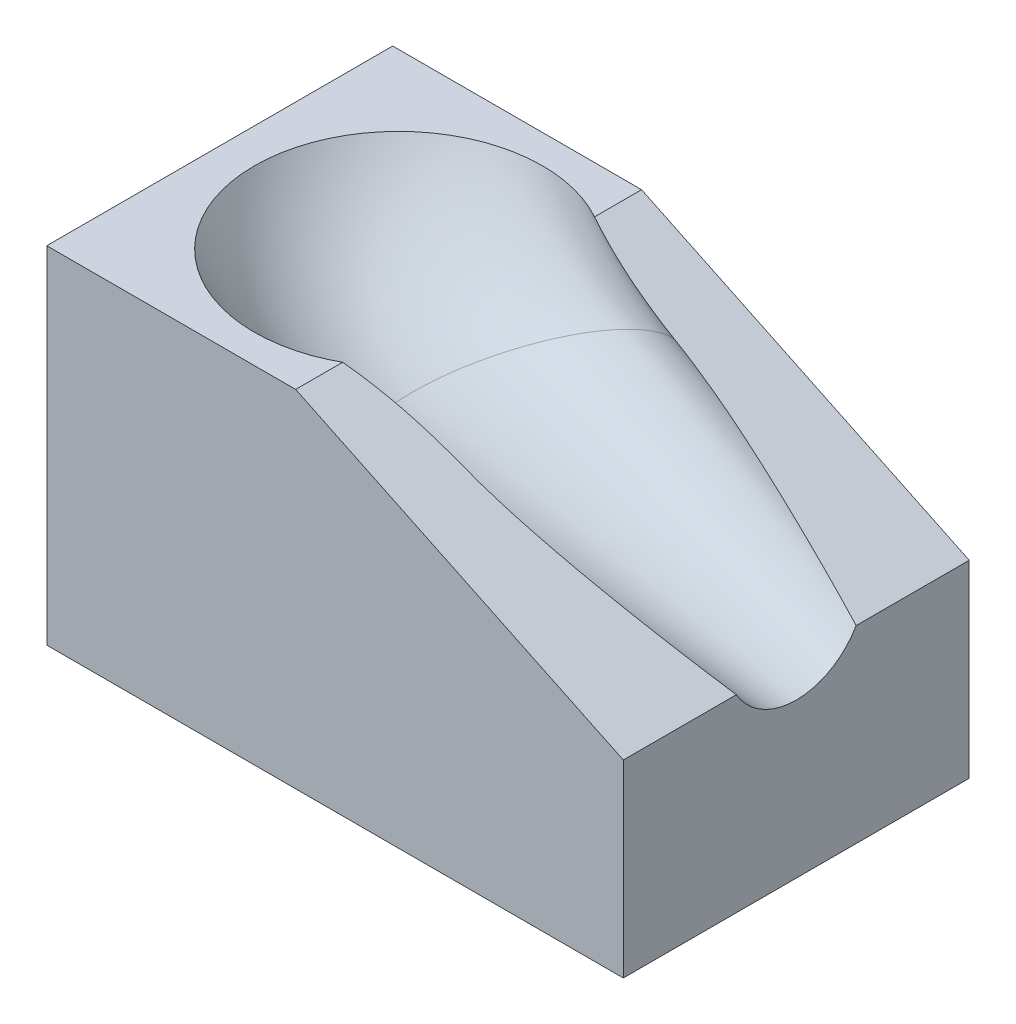
ISO-10303-21;
HEADER;
FILE_DESCRIPTION(('STEP AP214'),'2;1');
FILE_NAME('part.step','',(''),(''),'','','');
FILE_SCHEMA(('AUTOMOTIVE_DESIGN { 1 0 10303 214 1 1 1 1 }'));
ENDSEC;
DATA;
#1=APPLICATION_CONTEXT('core data for automotive mechanical design processes');
#2=APPLICATION_PROTOCOL_DEFINITION('international standard','automotive_design',2000,#1);
#3=PRODUCT_CONTEXT('',#1,'mechanical');
#4=PRODUCT('Part','Part','',(#3));
#5=PRODUCT_RELATED_PRODUCT_CATEGORY('part','',(#4));
#6=PRODUCT_DEFINITION_FORMATION('','',#4);
#7=PRODUCT_DEFINITION_CONTEXT('part definition',#1,'design');
#8=PRODUCT_DEFINITION('design','',#6,#7);
#9=PRODUCT_DEFINITION_SHAPE('','',#8);
#10=(LENGTH_UNIT() NAMED_UNIT(*) SI_UNIT(.MILLI.,.METRE.));
#11=(NAMED_UNIT(*) PLANE_ANGLE_UNIT() SI_UNIT($,.RADIAN.));
#12=(NAMED_UNIT(*) SI_UNIT($,.STERADIAN.) SOLID_ANGLE_UNIT());
#13=UNCERTAINTY_MEASURE_WITH_UNIT(LENGTH_MEASURE(1.E-05),#10,'distance_accuracy_value','');
#14=(GEOMETRIC_REPRESENTATION_CONTEXT(3) GLOBAL_UNCERTAINTY_ASSIGNED_CONTEXT((#13)) GLOBAL_UNIT_ASSIGNED_CONTEXT((#10,
#11,#12)) REPRESENTATION_CONTEXT('',''));
#15=CARTESIAN_POINT('',(0.,0.,0.));
#16=DIRECTION('',(0.,0.,1.));
#17=DIRECTION('',(1.,0.,0.));
#18=AXIS2_PLACEMENT_3D('',#15,#16,#17);
#19=CARTESIAN_POINT('',(21.5839694656488,30.,15.));
#20=DIRECTION('',(-0.432376669649816,-0.901693082785121,0.));
#21=DIRECTION('',(0.901693082785121,-0.432376669649816,0.));
#22=AXIS2_PLACEMENT_3D('',#19,#20,#21);
#23=PLANE('',#22);
#24=CARTESIAN_POINT('',(21.5839694656486,30.,-10.919340613132));
#25=CARTESIAN_POINT('',(21.710412416116,29.9393685247592,-10.8772290723294));
#26=CARTESIAN_POINT('',(21.8370421361183,29.8786474904532,-10.8358080970463));
#27=CARTESIAN_POINT('',(22.0906916703588,29.7570183652365,-10.7544542890336));
#28=CARTESIAN_POINT('',(22.217711490828,29.6961102713379,-10.7145214802094));
#29=CARTESIAN_POINT('',(22.5993806580954,29.5130936256502,-10.5971160330896));
#30=CARTESIAN_POINT('',(22.8546339264675,29.3906954835295,-10.5220383108888));
#31=CARTESIAN_POINT('',(23.3665145319301,29.1452403107288,-10.3788291570108));
#32=CARTESIAN_POINT('',(23.6231406852334,29.0221838476942,-10.3106925203233));
#33=CARTESIAN_POINT('',(24.1378218204988,28.7753857747731,-10.1814504777418));
#34=CARTESIAN_POINT('',(24.3958767627952,28.651644183907,-10.1203448776693));
#35=CARTESIAN_POINT('',(24.8788528294104,28.4200492130787,-10.0127192041851));
#36=CARTESIAN_POINT('',(25.1036187495999,28.3122702560503,-9.96534002460255));
#37=CARTESIAN_POINT('',(25.5539622178243,28.0963231530871,-9.87560948090011));
#38=CARTESIAN_POINT('',(25.7795397698737,27.9881550052273,-9.83325814168493));
#39=CARTESIAN_POINT('',(26.4574183008858,27.6631010957964,-9.71338287216062));
#40=CARTESIAN_POINT('',(26.910770246602,27.4457113783744,-9.64305863402589));
#41=CARTESIAN_POINT('',(27.5932760283685,27.11843862607,-9.55015877570098));
#42=CARTESIAN_POINT('',(27.821756107271,27.0088786688259,-9.521234384241));
#43=CARTESIAN_POINT('',(28.2791034892705,26.7895730739652,-9.46735180896929));
#44=CARTESIAN_POINT('',(28.5079707988605,26.679827433235,-9.44239369234334));
#45=CARTESIAN_POINT('',(28.9658894098282,26.460247924685,-9.39612059219671));
#46=CARTESIAN_POINT('',(29.1949405685952,26.3504141252494,-9.37480385173653));
#47=CARTESIAN_POINT('',(29.653253489568,26.130645538564,-9.33535546978077));
#48=CARTESIAN_POINT('',(29.8825152390228,26.0207107574285,-9.31722364677216));
#49=CARTESIAN_POINT('',(30.111853390463,25.9107393402839,-9.30046144393203));
#50=B_SPLINE_CURVE_WITH_KNOTS('',3,(#24,#25,#26,#27,#28,#29,#30,#31,#32,#33,#34,#35,#36,#37,#38,
#39,#40,#41,#42,#43,#44,#45,#46,#47,#48,#49),.UNSPECIFIED.,.F.,.F.,(4,2,2,2,2,2,2,2,2,2,2,2,4),
(0.,0.439242362127457,0.878491777038882,1.75701070515304,2.63486591982865,3.51269688466002,
4.27384390699156,5.03499469940759,6.55761802449326,7.32270351961366,8.08780197333807,
8.85253022307231,9.61721487569635),.UNSPECIFIED.);
#51=CARTESIAN_POINT('',(21.5839694164023,30.,-10.9194974067952));
#52=VERTEX_POINT('',#51);
#53=CARTESIAN_POINT('',(30.1118533921906,25.9107393446141,-9.30046144136954));
#54=VERTEX_POINT('',#53);
#55=EDGE_CURVE('E193',#52,#54,#50,.T.);
#56=ORIENTED_EDGE('',*,*,#55,.T.);
#57=CARTESIAN_POINT('',(30.111853391185,25.910739342517,-9.30046144136954));
#58=CARTESIAN_POINT('',(30.4714576232283,25.7383031946724,-9.27947688140507));
#59=CARTESIAN_POINT('',(30.8307546218189,25.5660143712988,-9.25282796952547));
#60=CARTESIAN_POINT('',(31.5484864320297,25.2218501582504,-9.18975103156465));
#61=CARTESIAN_POINT('',(31.9069215685033,25.0499746128025,-9.1533275887777));
#62=CARTESIAN_POINT('',(32.6229817285135,24.7066119841595,-9.07223284959646));
#63=CARTESIAN_POINT('',(32.9806068319491,24.5351248626515,-9.02756240603464));
#64=CARTESIAN_POINT('',(33.6946700211147,24.1927198142182,-8.93122549340731));
#65=CARTESIAN_POINT('',(34.0511089971721,24.0218014603662,-8.87956709427554));
#66=CARTESIAN_POINT('',(34.7632672836824,23.6803098441445,-8.77019741013959));
#67=CARTESIAN_POINT('',(35.1189865092259,23.5097366224902,-8.71248544910091));
#68=CARTESIAN_POINT('',(35.8297120375629,23.1689320373751,-8.59181420433288));
#69=CARTESIAN_POINT('',(36.1847183116936,22.9987006876585,-8.52885471379635));
#70=CARTESIAN_POINT('',(36.9166070594795,22.6477479906014,-8.39419320115878));
#71=CARTESIAN_POINT('',(37.2934443311992,22.4670483183326,-8.32218980561944));
#72=CARTESIAN_POINT('',(38.0463685005921,22.1060087904972,-8.17363118177455));
#73=CARTESIAN_POINT('',(38.4224554325271,21.9256689185016,-8.09707616645937));
#74=CARTESIAN_POINT('',(39.1739316278762,21.5653237180455,-7.93989612374819));
#75=CARTESIAN_POINT('',(39.5493208987717,21.3853183859975,-7.85927114026096));
#76=CARTESIAN_POINT('',(40.2996636532978,21.0255166890656,-7.69437203052432));
#77=CARTESIAN_POINT('',(40.6746167769292,20.8457204968071,-7.61009589337647));
#78=CARTESIAN_POINT('',(41.4239320723849,20.4864114834053,-7.43835777612344));
#79=CARTESIAN_POINT('',(41.7982942387675,20.3068986648713,-7.35089576685811));
#80=CARTESIAN_POINT('',(42.5464636325452,19.9481391301787,-7.17308795698137));
#81=CARTESIAN_POINT('',(42.9202708559059,19.7688924159546,-7.08274213551121));
#82=CARTESIAN_POINT('',(43.6682264049995,19.4102354233067,-6.89916465266194));
#83=CARTESIAN_POINT('',(44.0423734806152,19.2308257443344,-6.80592673053116));
#84=CARTESIAN_POINT('',(44.7901378033724,18.8722604478612,-6.61688828070089));
#85=CARTESIAN_POINT('',(45.1637550544669,18.6931048284647,-6.52108777222828));
#86=CARTESIAN_POINT('',(45.9104524366897,18.3350511475331,-6.32695687129063));
#87=CARTESIAN_POINT('',(46.2835325710984,18.1561530844251,-6.22862649434648));
#88=CARTESIAN_POINT('',(47.0287678584538,17.7988005020398,-6.02945285329185));
#89=CARTESIAN_POINT('',(47.4009235557967,17.6203457217155,-5.92861209534767));
#90=CARTESIAN_POINT('',(48.1446243832386,17.2637289381068,-5.72418995815391));
#91=CARTESIAN_POINT('',(48.5161695111262,17.0855669358826,-5.62060856900156));
#92=CARTESIAN_POINT('',(49.2585971952203,16.7295606454573,-5.41054029480686));
#93=CARTESIAN_POINT('',(49.6294797412346,16.5517163621436,-5.30405336547315));
#94=CARTESIAN_POINT('',(50.,16.3740458015267,-5.19603263008346));
#95=B_SPLINE_CURVE_WITH_KNOTS('',3,(#57,#58,#59,#60,#61,#62,#63,#64,#65,#66,#67,#68,#69,#70,#71,
#72,#73,#74,#75,#76,#77,#78,#79,#80,#81,#82,#83,#84,#85,#86,#87,#88,#89,#90,#91,#92,#93,#94),
.UNSPECIFIED.,.F.,.F.,(4,2,2,2,2,2,2,2,2,2,2,2,2,2,2,2,2,2,4),(0.,1.19798316012101,
2.39540556244983,3.59270420714765,4.78863178963797,5.98469307040914,7.18080151073041,
8.45301028718924,9.72515957816707,10.9972951475185,12.2701404900612,13.5429974858376,
14.8158636903356,16.091709737111,17.3675462140032,18.6433748654363,19.9179772228617,
21.1925841864581,22.4672105907277),.UNSPECIFIED.);
#96=CARTESIAN_POINT('',(50.,16.3740458222505,-5.19612905522203));
#97=VERTEX_POINT('',#96);
#98=EDGE_CURVE('E13',#54,#97,#95,.T.);
#99=ORIENTED_EDGE('',*,*,#98,.T.);
#100=DIRECTION('',(0.,0.,-1.));
#101=VECTOR('',#100,1.);
#102=CARTESIAN_POINT('',(50.,16.3740458015267,15.));
#103=LINE('',#102,#101);
#104=CARTESIAN_POINT('',(50.,16.3740458015267,-15.));
#105=VERTEX_POINT('',#104);
#106=EDGE_CURVE('E179',#97,#105,#103,.T.);
#107=ORIENTED_EDGE('',*,*,#106,.T.);
#108=DIRECTION('',(-0.901693082785121,0.432376669649816,0.));
#109=VECTOR('',#108,1.);
#110=CARTESIAN_POINT('',(21.5839694656488,30.,-15.));
#111=LINE('',#110,#109);
#112=CARTESIAN_POINT('',(21.5839694656488,30.,-15.));
#113=VERTEX_POINT('',#112);
#114=EDGE_CURVE('E196',#105,#113,#111,.T.);
#115=ORIENTED_EDGE('',*,*,#114,.T.);
#116=DIRECTION('',(0.,0.,-1.));
#117=VECTOR('',#116,1.);
#118=CARTESIAN_POINT('',(21.5839694656488,30.,15.));
#119=LINE('',#118,#117);
#120=EDGE_CURVE('E180',#52,#113,#119,.T.);
#121=ORIENTED_EDGE('',*,*,#120,.F.);
#122=EDGE_LOOP('',(#56,#99,#107,#115,#121));
#123=FACE_BOUND('',#122,.T.);
#124=ADVANCED_FACE('F94',(#123),#23,.F.);
#125=CARTESIAN_POINT('',(50.,0.,15.));
#126=DIRECTION('',(0.,1.,0.));
#127=DIRECTION('',(-1.,0.,0.));
#128=AXIS2_PLACEMENT_3D('',#125,#126,#127);
#129=PLANE('',#128);
#130=DIRECTION('',(1.,0.,0.));
#131=VECTOR('',#130,1.);
#132=CARTESIAN_POINT('',(50.,0.,-15.));
#133=LINE('',#132,#131);
#134=CARTESIAN_POINT('',(0.,0.,-15.));
#135=VERTEX_POINT('',#134);
#136=CARTESIAN_POINT('',(50.,0.,-15.));
#137=VERTEX_POINT('',#136);
#138=EDGE_CURVE('E189',#135,#137,#133,.T.);
#139=ORIENTED_EDGE('',*,*,#138,.T.);
#140=DIRECTION('',(0.,0.,-1.));
#141=VECTOR('',#140,1.);
#142=CARTESIAN_POINT('',(50.,0.,15.));
#143=LINE('',#142,#141);
#144=CARTESIAN_POINT('',(50.,0.,15.));
#145=VERTEX_POINT('',#144);
#146=EDGE_CURVE('E212',#145,#137,#143,.T.);
#147=ORIENTED_EDGE('',*,*,#146,.F.);
#148=DIRECTION('',(1.,0.,0.));
#149=VECTOR('',#148,1.);
#150=CARTESIAN_POINT('',(50.,0.,15.));
#151=LINE('',#150,#149);
#152=CARTESIAN_POINT('',(0.,0.,15.));
#153=VERTEX_POINT('',#152);
#154=EDGE_CURVE('E202',#153,#145,#151,.T.);
#155=ORIENTED_EDGE('',*,*,#154,.F.);
#156=DIRECTION('',(0.,0.,-1.));
#157=VECTOR('',#156,1.);
#158=CARTESIAN_POINT('',(0.,0.,15.));
#159=LINE('',#158,#157);
#160=EDGE_CURVE('E185',#153,#135,#159,.T.);
#161=ORIENTED_EDGE('',*,*,#160,.T.);
#162=EDGE_LOOP('',(#139,#147,#155,#161));
#163=FACE_BOUND('',#162,.T.);
#164=ADVANCED_FACE('F96',(#163),#129,.F.);
#165=CARTESIAN_POINT('',(50.,16.3740458015267,15.));
#166=DIRECTION('',(-1.,0.,0.));
#167=DIRECTION('',(0.,0.,1.));
#168=AXIS2_PLACEMENT_3D('',#165,#166,#167);
#169=PLANE('',#168);
#170=CARTESIAN_POINT('',(50.,19.3740458015267,0.));
#171=DIRECTION('',(1.,0.,0.));
#172=DIRECTION('',(0.,0.,-1.));
#173=AXIS2_PLACEMENT_3D('',#170,#171,#172);
#174=CIRCLE('',#173,6.);
#175=CARTESIAN_POINT('',(50.,13.3740458015267,0.));
#176=VERTEX_POINT('',#175);
#177=EDGE_CURVE('E98',#176,#97,#174,.T.);
#178=ORIENTED_EDGE('',*,*,#177,.F.);
#179=CARTESIAN_POINT('',(50.,16.3740458161155,5.19611973316583));
#180=VERTEX_POINT('',#179);
#181=EDGE_CURVE('E285',#180,#176,#174,.T.);
#182=ORIENTED_EDGE('',*,*,#181,.F.);
#183=CARTESIAN_POINT('',(50.,16.3740458015267,15.));
#184=VERTEX_POINT('',#183);
#185=EDGE_CURVE('E214',#184,#180,#103,.T.);
#186=ORIENTED_EDGE('',*,*,#185,.F.);
#187=DIRECTION('',(0.,1.,0.));
#188=VECTOR('',#187,1.);
#189=CARTESIAN_POINT('',(50.,16.3740458015267,15.));
#190=LINE('',#189,#188);
#191=EDGE_CURVE('E155',#145,#184,#190,.T.);
#192=ORIENTED_EDGE('',*,*,#191,.F.);
#193=ORIENTED_EDGE('',*,*,#146,.T.);
#194=DIRECTION('',(0.,1.,0.));
#195=VECTOR('',#194,1.);
#196=CARTESIAN_POINT('',(50.,16.3740458015267,-15.));
#197=LINE('',#196,#195);
#198=EDGE_CURVE('E192',#137,#105,#197,.T.);
#199=ORIENTED_EDGE('',*,*,#198,.T.);
#200=ORIENTED_EDGE('',*,*,#106,.F.);
#201=EDGE_LOOP('',(#178,#182,#186,#192,#193,#199,#200));
#202=FACE_BOUND('',#201,.T.);
#203=ADVANCED_FACE('F274',(#202),#169,.F.);
#204=ORIENTED_EDGE('',*,*,#185,.T.);
#205=CARTESIAN_POINT('',(50.,16.3740458015267,5.19603263008345));
#206=CARTESIAN_POINT('',(49.6530542037739,16.5404120194619,5.29718482942509));
#207=CARTESIAN_POINT('',(49.3057895426816,16.7069311383469,5.39698742503108));
#208=CARTESIAN_POINT('',(48.6106766871939,17.0402491899374,5.59403377866549));
#209=CARTESIAN_POINT('',(48.262828502955,17.2070481177726,5.69127758074943));
#210=CARTESIAN_POINT('',(47.5665925905594,17.5409046936292,5.88334970979515));
#211=CARTESIAN_POINT('',(47.2182048651254,17.707962340345,5.97817804890439));
#212=CARTESIAN_POINT('',(46.5206344583596,18.0424588282099,6.16560435702598));
#213=CARTESIAN_POINT('',(46.1714513563242,18.2098978710932,6.25820039957715));
#214=CARTESIAN_POINT('',(45.4726093096161,18.545004131234,6.4411681975317));
#215=CARTESIAN_POINT('',(45.1229503617983,18.7126713499995,6.53153993815782));
#216=CARTESIAN_POINT('',(44.423166792228,19.0482290858445,6.71005335256534));
#217=CARTESIAN_POINT('',(44.0730421665794,19.2161196047922,6.79819500756356));
#218=CARTESIAN_POINT('',(43.3495226524537,19.5630591166026,6.9778375784863));
#219=CARTESIAN_POINT('',(42.9760964954957,19.7421231032165,7.06918371202454));
#220=CARTESIAN_POINT('',(42.2287006354382,20.1005117157626,7.24908721522868));
#221=CARTESIAN_POINT('',(41.8547309360547,20.2798363399129,7.33764460386807));
#222=CARTESIAN_POINT('',(41.1062173349486,20.638760927683,7.51170240771772));
#223=CARTESIAN_POINT('',(40.7316734398556,20.8183608881238,7.5972028579499));
#224=CARTESIAN_POINT('',(39.9821545190741,21.1777675432199,7.76473676276863));
#225=CARTESIAN_POINT('',(39.6071798130159,21.3575740846071,7.84677197297533));
#226=CARTESIAN_POINT('',(38.8565484515786,21.7175141733016,8.00694679261705));
#227=CARTESIAN_POINT('',(38.4808917879141,21.897647724582,8.08508635438919));
#228=CARTESIAN_POINT('',(37.7288424011904,22.2582677797336,8.23702244258828));
#229=CARTESIAN_POINT('',(37.3524496392236,22.4387543022617,8.31081873266184));
#230=CARTESIAN_POINT('',(36.5970875509728,22.8009628523027,8.45382890186144));
#231=CARTESIAN_POINT('',(36.2181145495823,22.9826866420897,8.52301898219025));
#232=CARTESIAN_POINT('',(35.4593689132508,23.3465176591083,8.65568488261297));
#233=CARTESIAN_POINT('',(35.0795963117481,23.5286248703057,8.71916093698703));
#234=CARTESIAN_POINT('',(34.3192400976172,23.8932281858795,8.83947546500719));
#235=CARTESIAN_POINT('',(33.9386565917751,24.0757242390503,8.89631476352634));
#236=CARTESIAN_POINT('',(33.1761544241275,24.4413565746449,9.00227925554781));
#237=CARTESIAN_POINT('',(32.7942347149805,24.6244933592862,9.05139523514176));
#238=CARTESIAN_POINT('',(32.0294645033825,24.9912132592735,9.14042855974279));
#239=CARTESIAN_POINT('',(31.6466139010888,25.1747964224956,9.18034486969433));
#240=CARTESIAN_POINT('',(30.8799120102656,25.5424425944551,9.24914886590969));
#241=CARTESIAN_POINT('',(30.4960603009124,25.7265058049844,9.2780307328808));
#242=CARTESIAN_POINT('',(30.1118533905817,25.910739340227,9.30046144398228));
#243=B_SPLINE_CURVE_WITH_KNOTS('',3,(#205,#206,#207,#208,#209,#210,#211,#212,#213,#214,#215,
#216,#217,#218,#219,#220,#221,#222,#223,#224,#225,#226,#227,#228,#229,#230,#231,#232,#233,#234,
#235,#236,#237,#238,#239,#240,#241,#242),.UNSPECIFIED.,.F.,.F.,(4,2,2,2,2,2,2,2,2,2,2,2,2,2,2,2,
2,2,4),(0.,1.19353175465557,2.38704294644249,3.5805481348183,4.77504889344162,5.96955758564526,
7.16407633539589,8.43634722558702,9.7086094578905,10.9808571098049,12.2524522671684,
13.5240629785578,14.795742824961,16.0735514743506,17.3513077085632,18.6289049628224,
19.908015010654,21.187268901079,22.4671965102009),.UNSPECIFIED.);
#244=CARTESIAN_POINT('',(30.1118533921906,25.910739344614,9.30046144136952));
#245=VERTEX_POINT('',#244);
#246=EDGE_CURVE('E104',#180,#245,#243,.T.);
#247=ORIENTED_EDGE('',*,*,#246,.T.);
#248=CARTESIAN_POINT('',(30.111853391185,25.9107393425169,9.30046144136952));
#249=CARTESIAN_POINT('',(29.8487566741022,26.0368985456976,9.31967957988337));
#250=CARTESIAN_POINT('',(29.5857589814933,26.1630102659884,9.34071605423612));
#251=CARTESIAN_POINT('',(29.060047042317,26.415097790389,9.3870684477746));
#252=CARTESIAN_POINT('',(28.7973328245991,26.5410735806651,9.41238476752204));
#253=CARTESIAN_POINT('',(28.2721888879973,26.7928887391152,9.46795040834071));
#254=CARTESIAN_POINT('',(28.0097593820833,26.9187280051665,9.49820223460091));
#255=CARTESIAN_POINT('',(27.4854632659396,27.1701366195872,9.56411292645334));
#256=CARTESIAN_POINT('',(27.2235966369794,27.2957059769382,9.59977160921029));
#257=CARTESIAN_POINT('',(26.5086187815848,27.6385496228592,9.70528361355689));
#258=CARTESIAN_POINT('',(26.0561976406345,27.8554930040727,9.78102621823001));
#259=CARTESIAN_POINT('',(25.1545092493978,28.2878674240424,9.95230213802759));
#260=CARTESIAN_POINT('',(24.7052411497452,28.5032988700836,10.0478298938705));
#261=CARTESIAN_POINT('',(24.0329735788863,28.8256622317991,10.2072762361063));
#262=CARTESIAN_POINT('',(23.8084387754371,28.9333303645475,10.2633236309516));
#263=CARTESIAN_POINT('',(23.3604956800295,29.1481264492493,10.3807398579677));
#264=CARTESIAN_POINT('',(23.1370874085355,29.2552543913896,10.442108786443));
#265=CARTESIAN_POINT('',(22.6913572563945,29.4689893333831,10.5700529436732));
#266=CARTESIAN_POINT('',(22.46903604994,29.57559600995,10.6366310523768));
#267=CARTESIAN_POINT('',(22.025601930022,29.7882299667147,10.7745330528076));
#268=CARTESIAN_POINT('',(21.8044889684868,29.8942572699637,10.8458567542154));
#269=CARTESIAN_POINT('',(21.583969465654,30.0000000000016,10.9193406131293));
#270=B_SPLINE_CURVE_WITH_KNOTS('',3,(#248,#249,#250,#251,#252,#253,#254,#255,#256,#257,#258,
#259,#260,#261,#262,#263,#264,#265,#266,#267,#268,#269),.UNSPECIFIED.,.F.,.F.,(4,2,2,2,2,2,2,2,
2,2,4),(0.,0.877248053999921,1.75457825739477,2.63235517387693,3.51010241455489,
5.03203161583628,6.55353376036897,7.31921616484648,8.08491242887757,8.8510350484971,
9.61712696169559),.UNSPECIFIED.);
#271=CARTESIAN_POINT('',(21.5839694230081,30.,10.9194920312761));
#272=VERTEX_POINT('',#271);
#273=EDGE_CURVE('E177',#245,#272,#270,.T.);
#274=ORIENTED_EDGE('',*,*,#273,.T.);
#275=CARTESIAN_POINT('',(21.5839694656488,30.,15.));
#276=VERTEX_POINT('',#275);
#277=EDGE_CURVE('E172',#276,#272,#119,.T.);
#278=ORIENTED_EDGE('',*,*,#277,.F.);
#279=DIRECTION('',(-0.901693082785121,0.432376669649816,0.));
#280=VECTOR('',#279,1.);
#281=CARTESIAN_POINT('',(21.5839694656488,30.,15.));
#282=LINE('',#281,#280);
#283=EDGE_CURVE('E161',#184,#276,#282,.T.);
#284=ORIENTED_EDGE('',*,*,#283,.F.);
#285=EDGE_LOOP('',(#204,#247,#274,#278,#284));
#286=FACE_BOUND('',#285,.T.);
#287=ADVANCED_FACE('F173',(#286),#23,.F.);
#288=CARTESIAN_POINT('',(0.,30.,15.));
#289=DIRECTION('',(0.,-1.,0.));
#290=DIRECTION('',(0.,0.,-1.));
#291=AXIS2_PLACEMENT_3D('',#288,#289,#290);
#292=PLANE('',#291);
#293=CARTESIAN_POINT('',(3.,30.,0.));
#294=CARTESIAN_POINT('',(3.,30.,1.63624616068757));
#295=CARTESIAN_POINT('',(3.65016572314092,30.,4.90821213050574));
#296=CARTESIAN_POINT('',(6.43087825317787,30.,9.06929436590044));
#297=CARTESIAN_POINT('',(10.5916991796986,29.9999999999999,11.8495297737998));
#298=CARTESIAN_POINT('',(15.5,30.0000000000001,12.8258857533302));
#299=CARTESIAN_POINT('',(20.4083008203013,29.9999999999999,11.8495297737998));
#300=CARTESIAN_POINT('',(24.5691217468222,30.,9.06929436590048));
#301=CARTESIAN_POINT('',(27.3498342768591,30.,4.90821213050572));
#302=CARTESIAN_POINT('',(28.,30.,1.63624616068757));
#303=CARTESIAN_POINT('',(28.,30.,-1.63624616068757));
#304=CARTESIAN_POINT('',(27.3498342768591,30.0000000000001,-4.90821213050571));
#305=CARTESIAN_POINT('',(24.5691217468221,29.9999999999999,-9.06929436590047));
#306=CARTESIAN_POINT('',(20.4083008203014,30.0000000000001,-11.8495297737998));
#307=CARTESIAN_POINT('',(15.5,29.9999999999999,-12.8258857533302));
#308=CARTESIAN_POINT('',(10.5916991796986,30.0000000000001,-11.8495297737997));
#309=CARTESIAN_POINT('',(6.43087825317787,29.9999999999999,-9.06929436590046));
#310=CARTESIAN_POINT('',(3.65016572314091,30.0000000000001,-4.90821213050573));
#311=CARTESIAN_POINT('',(3.,30.,-1.63624616068758));
#312=CARTESIAN_POINT('',(3.,30.,0.));
#313=B_SPLINE_CURVE_WITH_KNOTS('',3,(#293,#294,#295,#296,#297,#298,#299,#300,#301,#302,#303,
#304,#305,#306,#307,#308,#309,#310,#311,#312),.UNSPECIFIED.,.T.,.F.,(4,1,1,1,1,1,1,1,2,1,1,1,1,
1,1,1,4),(0.,0.0625,0.125,0.1875,0.25,0.3125,0.375,0.4375,0.5,0.5625,0.625,0.6875,0.75,0.8125,
0.875,0.9375,1.),.UNSPECIFIED.);
#314=CARTESIAN_POINT('',(3.,30.,0.));
#315=VERTEX_POINT('',#314);
#316=EDGE_CURVE('E213',#272,#315,#313,.F.);
#317=ORIENTED_EDGE('',*,*,#316,.T.);
#318=CARTESIAN_POINT('',(3.,30.,0.));
#319=CARTESIAN_POINT('',(3.,30.,1.63624616068757));
#320=CARTESIAN_POINT('',(3.65016572314092,30.,4.90821213050574));
#321=CARTESIAN_POINT('',(6.43087825317787,30.,9.06929436590044));
#322=CARTESIAN_POINT('',(10.5916991796986,29.9999999999999,11.8495297737998));
#323=CARTESIAN_POINT('',(15.5,30.0000000000001,12.8258857533302));
#324=CARTESIAN_POINT('',(20.4083008203013,29.9999999999999,11.8495297737998));
#325=CARTESIAN_POINT('',(24.5691217468222,30.,9.06929436590048));
#326=CARTESIAN_POINT('',(27.3498342768591,30.,4.90821213050572));
#327=CARTESIAN_POINT('',(28.,30.,1.63624616068757));
#328=CARTESIAN_POINT('',(28.,30.,-1.63624616068757));
#329=CARTESIAN_POINT('',(27.3498342768591,30.0000000000001,-4.90821213050571));
#330=CARTESIAN_POINT('',(24.5691217468221,29.9999999999999,-9.06929436590047));
#331=CARTESIAN_POINT('',(20.4083008203014,30.0000000000001,-11.8495297737998));
#332=CARTESIAN_POINT('',(15.5,29.9999999999999,-12.8258857533302));
#333=CARTESIAN_POINT('',(10.5916991796986,30.0000000000001,-11.8495297737997));
#334=CARTESIAN_POINT('',(6.43087825317787,29.9999999999999,-9.06929436590046));
#335=CARTESIAN_POINT('',(3.65016572314091,30.0000000000001,-4.90821213050573));
#336=CARTESIAN_POINT('',(3.,30.,-1.63624616068758));
#337=CARTESIAN_POINT('',(3.,30.,0.));
#338=B_SPLINE_CURVE_WITH_KNOTS('',3,(#318,#319,#320,#321,#322,#323,#324,#325,#326,#327,#328,
#329,#330,#331,#332,#333,#334,#335,#336,#337),.UNSPECIFIED.,.T.,.F.,(4,1,1,1,1,1,1,1,2,1,1,1,1,
1,1,1,4),(0.,0.0625,0.125,0.1875,0.25,0.3125,0.375,0.4375,0.5,0.5625,0.625,0.6875,0.75,0.8125,
0.875,0.9375,1.),.UNSPECIFIED.);
#339=EDGE_CURVE('E112',#315,#52,#338,.F.);
#340=ORIENTED_EDGE('',*,*,#339,.T.);
#341=ORIENTED_EDGE('',*,*,#120,.T.);
#342=DIRECTION('',(-1.,0.,0.));
#343=VECTOR('',#342,1.);
#344=CARTESIAN_POINT('',(0.,30.,-15.));
#345=LINE('',#344,#343);
#346=CARTESIAN_POINT('',(0.,30.,-15.));
#347=VERTEX_POINT('',#346);
#348=EDGE_CURVE('E199',#113,#347,#345,.T.);
#349=ORIENTED_EDGE('',*,*,#348,.T.);
#350=DIRECTION('',(0.,0.,-1.));
#351=VECTOR('',#350,1.);
#352=CARTESIAN_POINT('',(0.,30.,15.));
#353=LINE('',#352,#351);
#354=CARTESIAN_POINT('',(0.,30.,15.));
#355=VERTEX_POINT('',#354);
#356=EDGE_CURVE('E183',#355,#347,#353,.T.);
#357=ORIENTED_EDGE('',*,*,#356,.F.);
#358=DIRECTION('',(-1.,0.,0.));
#359=VECTOR('',#358,1.);
#360=CARTESIAN_POINT('',(0.,30.,15.));
#361=LINE('',#360,#359);
#362=EDGE_CURVE('E165',#276,#355,#361,.T.);
#363=ORIENTED_EDGE('',*,*,#362,.F.);
#364=ORIENTED_EDGE('',*,*,#277,.T.);
#365=EDGE_LOOP('',(#317,#340,#341,#349,#357,#363,#364));
#366=FACE_BOUND('',#365,.T.);
#367=ADVANCED_FACE('F182',(#366),#292,.F.);
#368=CARTESIAN_POINT('',(0.,0.,15.));
#369=DIRECTION('',(1.,0.,0.));
#370=DIRECTION('',(0.,0.,-1.));
#371=AXIS2_PLACEMENT_3D('',#368,#369,#370);
#372=PLANE('',#371);
#373=DIRECTION('',(0.,-1.,0.));
#374=VECTOR('',#373,1.);
#375=CARTESIAN_POINT('',(0.,0.,-15.));
#376=LINE('',#375,#374);
#377=EDGE_CURVE('E146',#347,#135,#376,.T.);
#378=ORIENTED_EDGE('',*,*,#377,.T.);
#379=ORIENTED_EDGE('',*,*,#160,.F.);
#380=DIRECTION('',(0.,-1.,0.));
#381=VECTOR('',#380,1.);
#382=CARTESIAN_POINT('',(0.,0.,15.));
#383=LINE('',#382,#381);
#384=EDGE_CURVE('E122',#355,#153,#383,.T.);
#385=ORIENTED_EDGE('',*,*,#384,.F.);
#386=ORIENTED_EDGE('',*,*,#356,.T.);
#387=EDGE_LOOP('',(#378,#379,#385,#386));
#388=FACE_BOUND('',#387,.T.);
#389=ADVANCED_FACE('F343',(#388),#372,.F.);
#390=CARTESIAN_POINT('',(0.,0.,15.));
#391=DIRECTION('',(0.,0.,-1.));
#392=DIRECTION('',(-1.,0.,0.));
#393=AXIS2_PLACEMENT_3D('',#390,#391,#392);
#394=PLANE('',#393);
#395=ORIENTED_EDGE('',*,*,#154,.T.);
#396=ORIENTED_EDGE('',*,*,#191,.T.);
#397=ORIENTED_EDGE('',*,*,#283,.T.);
#398=ORIENTED_EDGE('',*,*,#362,.T.);
#399=ORIENTED_EDGE('',*,*,#384,.T.);
#400=EDGE_LOOP('',(#395,#396,#397,#398,#399));
#401=FACE_BOUND('',#400,.T.);
#402=ADVANCED_FACE('F163',(#401),#394,.F.);
#403=CARTESIAN_POINT('',(0.,0.,-15.));
#404=DIRECTION('',(0.,0.,-1.));
#405=DIRECTION('',(-1.,0.,0.));
#406=AXIS2_PLACEMENT_3D('',#403,#404,#405);
#407=PLANE('',#406);
#408=ORIENTED_EDGE('',*,*,#138,.F.);
#409=ORIENTED_EDGE('',*,*,#377,.F.);
#410=ORIENTED_EDGE('',*,*,#348,.F.);
#411=ORIENTED_EDGE('',*,*,#114,.F.);
#412=ORIENTED_EDGE('',*,*,#198,.F.);
#413=EDGE_LOOP('',(#408,#409,#410,#411,#412));
#414=FACE_BOUND('',#413,.T.);
#415=ADVANCED_FACE('F242',(#414),#407,.T.);
#416=CARTESIAN_POINT('',(16.725802318551,19.8734935943102,0.));
#417=CARTESIAN_POINT('',(27.8172015457007,17.7070109967157,0.));
#418=CARTESIAN_POINT('',(38.9086007728503,15.5405283991212,0.));
#419=CARTESIAN_POINT('',(50.,13.3740458015267,0.));
#420=CARTESIAN_POINT('',(16.725802318551,19.8734935943102,-1.34365085076231));
#421=CARTESIAN_POINT('',(27.8172015457007,17.7070109967157,-1.15756661955155));
#422=CARTESIAN_POINT('',(38.9086007728503,15.5405283991212,-0.971482388340793));
#423=CARTESIAN_POINT('',(50.,13.3740458015267,-0.785398157130034));
#424=CARTESIAN_POINT('',(17.2285369627426,20.1185767580387,-4.03048591313733));
#425=CARTESIAN_POINT('',(28.1523579751618,17.9744068765932,-3.47227119529293));
#426=CARTESIAN_POINT('',(39.0761789875809,15.8302369951476,-2.91405647744853));
#427=CARTESIAN_POINT('',(50.,13.6860671137021,-2.35584175960413));
#428=CARTESIAN_POINT('',(19.3385704357005,21.0942818013445,-7.44751174106171));
#429=CARTESIAN_POINT('',(29.5590469571337,19.0698084312689,-6.41609338712032));
#430=CARTESIAN_POINT('',(39.7795234785668,17.0453350611934,-5.38467503317894));
#431=CARTESIAN_POINT('',(50.,15.0208616911178,-4.35325667923755));
#432=CARTESIAN_POINT('',(22.4683397831414,22.5044393434713,-9.73057490897759));
#433=CARTESIAN_POINT('',(31.6455598554276,20.6756325515244,-8.38296586120632));
#434=CARTESIAN_POINT('',(40.8227799277138,18.8468257595775,-7.03535681343504));
#435=CARTESIAN_POINT('',(50.,17.0180189676307,-5.68774776566377));
#436=CARTESIAN_POINT('',(26.1456548305783,24.1413447413572,-10.5323536719396));
#437=CARTESIAN_POINT('',(34.0971032203856,22.552245094747,-9.07371732458397));
#438=CARTESIAN_POINT('',(42.0485516101928,20.9631454481368,-7.61508097722831));
#439=CARTESIAN_POINT('',(50.,19.3740458015267,-6.15644462987265));
#440=CARTESIAN_POINT('',(29.8229698780151,25.7782501392433,-9.7305749089776));
#441=CARTESIAN_POINT('',(36.5486465853434,24.4288576379698,-8.38296586120632));
#442=CARTESIAN_POINT('',(43.2743232926716,23.0794651366963,-7.03535681343504));
#443=CARTESIAN_POINT('',(49.9999999999999,21.7300726354228,-5.68774776566377));
#444=CARTESIAN_POINT('',(32.9527392254561,27.1884076813698,-7.44751174106172));
#445=CARTESIAN_POINT('',(38.6351594836374,26.0346817582251,-6.41609338712033));
#446=CARTESIAN_POINT('',(44.3175797418188,24.8809558350803,-5.38467503317895));
#447=CARTESIAN_POINT('',(50.0000000000001,23.7272299119356,-4.35325667923756));
#448=CARTESIAN_POINT('',(35.0627726984139,28.1641127246759,-4.03048591313732));
#449=CARTESIAN_POINT('',(40.0418484656093,27.130083312901,-3.47227119529292));
#450=CARTESIAN_POINT('',(45.0209242328046,26.0960539011262,-2.91405647744853));
#451=CARTESIAN_POINT('',(50.,25.0620244893513,-2.35584175960413));
#452=CARTESIAN_POINT('',(35.5655073426055,28.4091958884043,-1.34365085076231));
#453=CARTESIAN_POINT('',(40.3770048950703,27.3974791927784,-1.15756661955155));
#454=CARTESIAN_POINT('',(45.1885024475352,26.3857624971526,-0.971482388340793));
#455=CARTESIAN_POINT('',(50.,25.3740458015267,-0.785398157130035));
#456=CARTESIAN_POINT('',(35.5655073426055,28.4091958884043,1.34365085076231));
#457=CARTESIAN_POINT('',(40.3770048950703,27.3974791927784,1.15756661955155));
#458=CARTESIAN_POINT('',(45.1885024475352,26.3857624971526,0.971482388340793));
#459=CARTESIAN_POINT('',(50.,25.3740458015267,0.785398157130034));
#460=CARTESIAN_POINT('',(35.0627726984139,28.1641127246758,4.03048591313732));
#461=CARTESIAN_POINT('',(40.0418484656092,27.130083312901,3.47227119529292));
#462=CARTESIAN_POINT('',(45.0209242328046,26.0960539011262,2.91405647744853));
#463=CARTESIAN_POINT('',(50.,25.0620244893513,2.35584175960413));
#464=CARTESIAN_POINT('',(32.9527392254561,27.1884076813699,7.44751174106172));
#465=CARTESIAN_POINT('',(38.6351594836374,26.0346817582251,6.41609338712034));
#466=CARTESIAN_POINT('',(44.3175797418187,24.8809558350803,5.38467503317895));
#467=CARTESIAN_POINT('',(50.,23.7272299119355,4.35325667923756));
#468=CARTESIAN_POINT('',(29.8229698780152,25.7782501392432,9.7305749089776));
#469=CARTESIAN_POINT('',(36.5486465853434,24.4288576379697,8.38296586120632));
#470=CARTESIAN_POINT('',(43.2743232926717,23.0794651366963,7.03535681343504));
#471=CARTESIAN_POINT('',(50.,21.7300726354228,5.68774776566376));
#472=CARTESIAN_POINT('',(26.1456548305783,24.1413447413573,10.5323536719396));
#473=CARTESIAN_POINT('',(34.0971032203855,22.5522450947471,9.07371732458395));
#474=CARTESIAN_POINT('',(42.0485516101927,20.9631454481369,7.6150809772283));
#475=CARTESIAN_POINT('',(50.,19.3740458015266,6.15644462987265));
#476=CARTESIAN_POINT('',(22.4683397831414,22.5044393434712,9.73057490897762));
#477=CARTESIAN_POINT('',(31.6455598554276,20.6756325515244,8.38296586120633));
#478=CARTESIAN_POINT('',(40.8227799277139,18.8468257595775,7.03535681343505));
#479=CARTESIAN_POINT('',(50.0000000000001,17.0180189676307,5.68774776566377));
#480=CARTESIAN_POINT('',(19.3385704357005,21.0942818013446,7.4475117410617));
#481=CARTESIAN_POINT('',(29.5590469571336,19.069808431269,6.41609338712032));
#482=CARTESIAN_POINT('',(39.7795234785668,17.0453350611934,5.38467503317894));
#483=CARTESIAN_POINT('',(49.9999999999999,15.0208616911178,4.35325667923755));
#484=CARTESIAN_POINT('',(17.2285369627427,20.1185767580386,4.03048591313734));
#485=CARTESIAN_POINT('',(28.1523579751618,17.9744068765931,3.47227119529294));
#486=CARTESIAN_POINT('',(39.0761789875809,15.8302369951476,2.91405647744853));
#487=CARTESIAN_POINT('',(50.,13.6860671137021,2.35584175960413));
#488=CARTESIAN_POINT('',(16.725802318551,19.8734935943102,1.34365085076231));
#489=CARTESIAN_POINT('',(27.8172015457007,17.7070109967157,1.15756661955155));
#490=CARTESIAN_POINT('',(38.9086007728503,15.5405283991212,0.971482388340793));
#491=CARTESIAN_POINT('',(50.,13.3740458015267,0.785398157130036));
#492=CARTESIAN_POINT('',(16.725802318551,19.8734935943102,0.));
#493=CARTESIAN_POINT('',(27.8172015457007,17.7070109967157,0.));
#494=CARTESIAN_POINT('',(38.9086007728503,15.5405283991212,0.));
#495=CARTESIAN_POINT('',(50.,13.3740458015267,0.));
#496=B_SPLINE_SURFACE_WITH_KNOTS('',3,3,((#416,#417,#418,#419),(#420,#421,#422,#423),(#424,#425,
#426,#427),(#428,#429,#430,#431),(#432,#433,#434,#435),(#436,#437,#438,#439),(#440,#441,#442,
#443),(#444,#445,#446,#447),(#448,#449,#450,#451),(#452,#453,#454,#455),(#456,#457,#458,#459),
(#460,#461,#462,#463),(#464,#465,#466,#467),(#468,#469,#470,#471),(#472,#473,#474,#475),(#476,
#477,#478,#479),(#480,#481,#482,#483),(#484,#485,#486,#487),(#488,#489,#490,#491),(#492,#493,
#494,#495)),.UNSPECIFIED.,.T.,.F.,.F.,(4,1,1,1,1,1,1,1,2,1,1,1,1,1,1,1,4),(4,4),(0.,0.0625,
0.125,0.1875,0.25,0.3125,0.375,0.4375,0.5,0.5625,0.625,0.6875,0.75,0.8125,0.875,0.9375,1.),
(0.343886697391159,1.),.UNSPECIFIED.);
#497=CARTESIAN_POINT('',(16.725802318551,19.8734935943102,0.));
#498=CARTESIAN_POINT('',(16.725802318551,19.8734935943102,-1.34365085076231));
#499=CARTESIAN_POINT('',(17.2285369627426,20.1185767580387,-4.03048591313733));
#500=CARTESIAN_POINT('',(19.3385704357005,21.0942818013445,-7.44751174106171));
#501=CARTESIAN_POINT('',(22.4683397831414,22.5044393434713,-9.73057490897759));
#502=CARTESIAN_POINT('',(26.1456548305783,24.1413447413572,-10.5323536719396));
#503=CARTESIAN_POINT('',(29.8229698780151,25.7782501392433,-9.7305749089776));
#504=CARTESIAN_POINT('',(32.9527392254561,27.1884076813698,-7.44751174106172));
#505=CARTESIAN_POINT('',(35.0627726984139,28.1641127246759,-4.03048591313732));
#506=CARTESIAN_POINT('',(35.5655073426055,28.4091958884043,-1.34365085076231));
#507=CARTESIAN_POINT('',(35.5655073426055,28.4091958884043,1.34365085076231));
#508=CARTESIAN_POINT('',(35.0627726984139,28.1641127246758,4.03048591313732));
#509=CARTESIAN_POINT('',(32.9527392254561,27.1884076813699,7.44751174106172));
#510=CARTESIAN_POINT('',(29.8229698780152,25.7782501392432,9.7305749089776));
#511=CARTESIAN_POINT('',(26.1456548305783,24.1413447413573,10.5323536719396));
#512=CARTESIAN_POINT('',(22.4683397831414,22.5044393434712,9.73057490897762));
#513=CARTESIAN_POINT('',(19.3385704357005,21.0942818013446,7.4475117410617));
#514=CARTESIAN_POINT('',(17.2285369627427,20.1185767580386,4.03048591313734));
#515=CARTESIAN_POINT('',(16.725802318551,19.8734935943102,1.34365085076231));
#516=CARTESIAN_POINT('',(16.725802318551,19.8734935943102,0.));
#517=B_SPLINE_CURVE_WITH_KNOTS('',3,(#497,#498,#499,#500,#501,#502,#503,#504,#505,#506,#507,
#508,#509,#510,#511,#512,#513,#514,#515,#516),.UNSPECIFIED.,.T.,.F.,(4,1,1,1,1,1,1,1,2,1,1,1,1,
1,1,1,4),(0.,0.0625,0.125,0.1875,0.25,0.3125,0.375,0.4375,0.5,0.5625,0.625,0.6875,0.75,0.8125,
0.875,0.9375,1.),.UNSPECIFIED.);
#518=EDGE_CURVE('E300',#245,#54,#517,.T.);
#519=ORIENTED_EDGE('',*,*,#181,.T.);
#520=ORIENTED_EDGE('',*,*,#177,.T.);
#521=ORIENTED_EDGE('',*,*,#98,.F.);
#522=ORIENTED_EDGE('',*,*,#518,.F.);
#523=ORIENTED_EDGE('',*,*,#246,.F.);
#524=EDGE_LOOP('',(#519,#520,#521,#522,#523));
#525=FACE_BOUND('',#524,.T.);
#526=ADVANCED_FACE('F234',(#525),#496,.F.);
#527=CARTESIAN_POINT('',(3.,30.,0.));
#528=CARTESIAN_POINT('',(6.0033531331427,24.8947345364255,0.));
#529=CARTESIAN_POINT('',(10.9616327172981,21.2366569388568,0.));
#530=CARTESIAN_POINT('',(16.725802318551,19.8734935943102,0.));
#531=CARTESIAN_POINT('',(3.,30.,-1.63624616068758));
#532=CARTESIAN_POINT('',(6.0033531331427,24.8947345364255,-1.53871439071249));
#533=CARTESIAN_POINT('',(10.9616327172981,21.2366569388568,-1.4411826207374));
#534=CARTESIAN_POINT('',(16.725802318551,19.8734935943102,-1.34365085076231));
#535=CARTESIAN_POINT('',(3.65016572314091,30.0000000000001,-4.90821213050573));
#536=CARTESIAN_POINT('',(6.65349748537471,25.0304840283458,-4.61563672471626));
#537=CARTESIAN_POINT('',(11.5506642470271,21.4629313018847,-4.3230613189268));
#538=CARTESIAN_POINT('',(17.2285369627426,20.1185767580387,-4.03048591313733));
#539=CARTESIAN_POINT('',(6.43087825317787,29.9999999999999,-9.06929436590046));
#540=CARTESIAN_POINT('',(9.39485903749688,25.5584256828214,-8.52870015762088));
#541=CARTESIAN_POINT('',(14.0235818777564,22.3492222827884,-7.98810594934129));
#542=CARTESIAN_POINT('',(19.3385704357005,21.0942818013445,-7.44751174106171));
#543=CARTESIAN_POINT('',(10.5916991796986,30.0000000000001,-11.8495297737997));
#544=CARTESIAN_POINT('',(13.4698882952138,26.3122674929203,-11.1432114855257));
#545=CARTESIAN_POINT('',(17.6920893458003,23.6194766437194,-10.4368931972516));
#546=CARTESIAN_POINT('',(22.4683397831414,22.5044393434713,-9.73057490897759));
#547=CARTESIAN_POINT('',(15.5,29.9999999999999,-12.8258857533302));
#548=CARTESIAN_POINT('',(18.2625944570056,27.1822332496134,-12.0613750595334));
#549=CARTESIAN_POINT('',(22.0026521395176,25.0880604322297,-11.2968643657365));
#550=CARTESIAN_POINT('',(26.1456548305783,24.1413447413572,-10.5323536719396));
#551=CARTESIAN_POINT('',(20.4083008203014,30.0000000000001,-11.8495297737998));
#552=CARTESIAN_POINT('',(23.0553006187973,28.0521990063068,-11.1432114855257));
#553=CARTESIAN_POINT('',(26.3132149332347,26.5566442207403,-10.4368931972517));
#554=CARTESIAN_POINT('',(29.8229698780151,25.7782501392433,-9.7305749089776));
#555=CARTESIAN_POINT('',(24.5691217468221,29.9999999999999,-9.06929436590047));
#556=CARTESIAN_POINT('',(27.1303298765143,28.8060408164054,-8.52870015762089));
#557=CARTESIAN_POINT('',(29.9817224012788,27.8268985816711,-7.9881059493413));
#558=CARTESIAN_POINT('',(32.9527392254561,27.1884076813698,-7.44751174106172));
#559=CARTESIAN_POINT('',(27.3498342768591,30.0000000000001,-4.90821213050571));
#560=CARTESIAN_POINT('',(29.8716914286365,29.3339824708812,-4.61563672471625));
#561=CARTESIAN_POINT('',(32.4546400320081,28.7131895625751,-4.32306131892678));
#562=CARTESIAN_POINT('',(35.0627726984139,28.1641127246759,-4.03048591313732));
#563=CARTESIAN_POINT('',(28.,30.,-1.63624616068757));
#564=CARTESIAN_POINT('',(30.5218357808685,29.4697319628014,-1.53871439071249));
#565=CARTESIAN_POINT('',(33.043671561737,28.9394639256028,-1.4411826207374));
#566=CARTESIAN_POINT('',(35.5655073426055,28.4091958884043,-1.34365085076231));
#567=CARTESIAN_POINT('',(28.,30.,1.63624616068757));
#568=CARTESIAN_POINT('',(30.5218357808685,29.4697319628014,1.53871439071249));
#569=CARTESIAN_POINT('',(33.043671561737,28.9394639256028,1.4411826207374));
#570=CARTESIAN_POINT('',(35.5655073426055,28.4091958884043,1.34365085076231));
#571=CARTESIAN_POINT('',(27.3498342768591,30.,4.90821213050572));
#572=CARTESIAN_POINT('',(29.8716914286365,29.3339824708812,4.61563672471625));
#573=CARTESIAN_POINT('',(32.454640032008,28.713189562575,4.32306131892679));
#574=CARTESIAN_POINT('',(35.0627726984139,28.1641127246758,4.03048591313732));
#575=CARTESIAN_POINT('',(24.5691217468222,30.,9.06929436590048));
#576=CARTESIAN_POINT('',(27.1303298765144,28.8060408164055,8.52870015762089));
#577=CARTESIAN_POINT('',(29.9817224012788,27.8268985816712,7.98810594934131));
#578=CARTESIAN_POINT('',(32.9527392254561,27.1884076813699,7.44751174106172));
#579=CARTESIAN_POINT('',(20.4083008203013,29.9999999999999,11.8495297737998));
#580=CARTESIAN_POINT('',(23.0553006187973,28.0521990063067,11.1432114855257));
#581=CARTESIAN_POINT('',(26.3132149332347,26.5566442207402,10.4368931972517));
#582=CARTESIAN_POINT('',(29.8229698780152,25.7782501392432,9.7305749089776));
#583=CARTESIAN_POINT('',(15.5,30.0000000000001,12.8258857533302));
#584=CARTESIAN_POINT('',(18.2625944570056,27.1822332496135,12.0613750595334));
#585=CARTESIAN_POINT('',(22.0026521395176,25.0880604322299,11.2968643657365));
#586=CARTESIAN_POINT('',(26.1456548305783,24.1413447413573,10.5323536719396));
#587=CARTESIAN_POINT('',(10.5916991796986,29.9999999999999,11.8495297737998));
#588=CARTESIAN_POINT('',(13.4698882952138,26.3122674929202,11.1432114855257));
#589=CARTESIAN_POINT('',(17.6920893458003,23.6194766437193,10.4368931972517));
#590=CARTESIAN_POINT('',(22.4683397831414,22.5044393434712,9.73057490897762));
#591=CARTESIAN_POINT('',(6.43087825317787,30.,9.06929436590044));
#592=CARTESIAN_POINT('',(9.39485903749686,25.5584256828215,8.52870015762086));
#593=CARTESIAN_POINT('',(14.0235818777564,22.3492222827884,7.98810594934128));
#594=CARTESIAN_POINT('',(19.3385704357005,21.0942818013446,7.4475117410617));
#595=CARTESIAN_POINT('',(3.65016572314092,30.,4.90821213050574));
#596=CARTESIAN_POINT('',(6.65349748537471,25.0304840283458,4.61563672471627));
#597=CARTESIAN_POINT('',(11.5506642470271,21.4629313018846,4.32306131892681));
#598=CARTESIAN_POINT('',(17.2285369627427,20.1185767580386,4.03048591313734));
#599=CARTESIAN_POINT('',(3.,30.,1.63624616068757));
#600=CARTESIAN_POINT('',(6.0033531331427,24.8947345364255,1.53871439071248));
#601=CARTESIAN_POINT('',(10.9616327172981,21.2366569388568,1.4411826207374));
#602=CARTESIAN_POINT('',(16.725802318551,19.8734935943102,1.34365085076231));
#603=CARTESIAN_POINT('',(3.,30.,0.));
#604=CARTESIAN_POINT('',(6.0033531331427,24.8947345364255,0.));
#605=CARTESIAN_POINT('',(10.9616327172981,21.2366569388568,0.));
#606=CARTESIAN_POINT('',(16.725802318551,19.8734935943102,0.));
#607=B_SPLINE_SURFACE_WITH_KNOTS('',3,3,((#527,#528,#529,#530),(#531,#532,#533,#534),(#535,#536,
#537,#538),(#539,#540,#541,#542),(#543,#544,#545,#546),(#547,#548,#549,#550),(#551,#552,#553,
#554),(#555,#556,#557,#558),(#559,#560,#561,#562),(#563,#564,#565,#566),(#567,#568,#569,#570),
(#571,#572,#573,#574),(#575,#576,#577,#578),(#579,#580,#581,#582),(#583,#584,#585,#586),(#587,
#588,#589,#590),(#591,#592,#593,#594),(#595,#596,#597,#598),(#599,#600,#601,#602),(#603,#604,
#605,#606)),.UNSPECIFIED.,.T.,.F.,.F.,(4,1,1,1,1,1,1,1,2,1,1,1,1,1,1,1,4),(4,4),(0.,0.0625,
0.125,0.1875,0.25,0.3125,0.375,0.4375,0.5,0.5625,0.625,0.6875,0.75,0.8125,0.875,0.9375,1.),(0.,
0.343886697391159),.UNSPECIFIED.);
#608=ORIENTED_EDGE('',*,*,#339,.F.);
#609=ORIENTED_EDGE('',*,*,#316,.F.);
#610=ORIENTED_EDGE('',*,*,#273,.F.);
#611=ORIENTED_EDGE('',*,*,#518,.T.);
#612=ORIENTED_EDGE('',*,*,#55,.F.);
#613=EDGE_LOOP('',(#608,#609,#610,#611,#612));
#614=FACE_BOUND('',#613,.T.);
#615=ADVANCED_FACE('F241',(#614),#607,.F.);
#616=CLOSED_SHELL('',(#124,#164,#203,#287,#367,#389,#402,#415,#526,#615));
#617=MANIFOLD_SOLID_BREP('B2',#616);
#618=ADVANCED_BREP_SHAPE_REPRESENTATION('',(#18,#617),#14);
#619=SHAPE_DEFINITION_REPRESENTATION(#9,#618);
ENDSEC;
END-ISO-10303-21;
